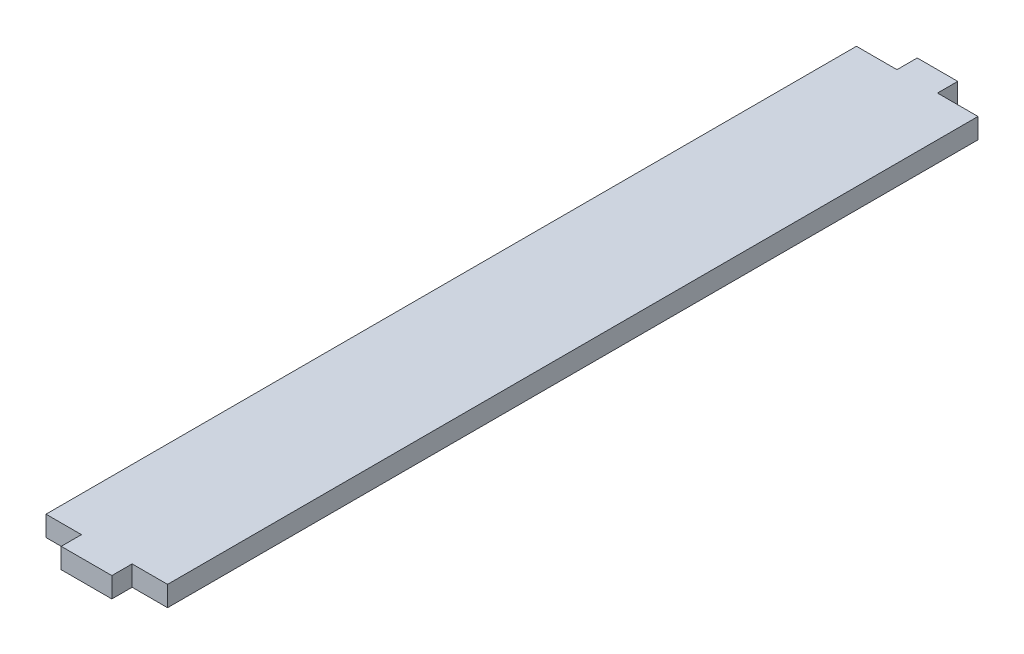
ISO-10303-21;
HEADER;
FILE_DESCRIPTION(('STEP AP214'),'2;1');
FILE_NAME('part.step','',(''),(''),'','','');
FILE_SCHEMA(('AUTOMOTIVE_DESIGN { 1 0 10303 214 1 1 1 1 }'));
ENDSEC;
DATA;
#1=APPLICATION_CONTEXT('core data for automotive mechanical design processes');
#2=APPLICATION_PROTOCOL_DEFINITION('international standard','automotive_design',2000,#1);
#3=PRODUCT_CONTEXT('',#1,'mechanical');
#4=PRODUCT('Part','Part','',(#3));
#5=PRODUCT_RELATED_PRODUCT_CATEGORY('part','',(#4));
#6=PRODUCT_DEFINITION_FORMATION('','',#4);
#7=PRODUCT_DEFINITION_CONTEXT('part definition',#1,'design');
#8=PRODUCT_DEFINITION('design','',#6,#7);
#9=PRODUCT_DEFINITION_SHAPE('','',#8);
#10=(LENGTH_UNIT() NAMED_UNIT(*) SI_UNIT(.MILLI.,.METRE.));
#11=(NAMED_UNIT(*) PLANE_ANGLE_UNIT() SI_UNIT($,.RADIAN.));
#12=(NAMED_UNIT(*) SI_UNIT($,.STERADIAN.) SOLID_ANGLE_UNIT());
#13=UNCERTAINTY_MEASURE_WITH_UNIT(LENGTH_MEASURE(1.E-05),#10,'distance_accuracy_value','');
#14=(GEOMETRIC_REPRESENTATION_CONTEXT(3) GLOBAL_UNCERTAINTY_ASSIGNED_CONTEXT((#13)) GLOBAL_UNIT_ASSIGNED_CONTEXT((#10,
#11,#12)) REPRESENTATION_CONTEXT('',''));
#15=CARTESIAN_POINT('',(0.,0.,0.));
#16=DIRECTION('',(0.,0.,1.));
#17=DIRECTION('',(1.,0.,0.));
#18=AXIS2_PLACEMENT_3D('',#15,#16,#17);
#19=CARTESIAN_POINT('',(-81.9746376057991,5.,31.5625003395719));
#20=DIRECTION('',(0.,0.,-1.));
#21=DIRECTION('',(-1.,0.,0.));
#22=AXIS2_PLACEMENT_3D('',#19,#20,#21);
#23=PLANE('',#22);
#24=DIRECTION('',(1.,0.,0.));
#25=VECTOR('',#24,1.);
#26=CARTESIAN_POINT('',(-81.9746376057991,0.,31.5625003395719));
#27=LINE('',#26,#25);
#28=CARTESIAN_POINT('',(89.4167837504382,0.,31.5625003395718));
#29=VERTEX_POINT('',#28);
#30=CARTESIAN_POINT('',(98.1667837504382,0.,31.5625003395718));
#31=VERTEX_POINT('',#30);
#32=EDGE_CURVE('E240',#29,#31,#27,.T.);
#33=ORIENTED_EDGE('',*,*,#32,.T.);
#34=DIRECTION('',(0.,-1.,0.));
#35=VECTOR('',#34,1.);
#36=CARTESIAN_POINT('',(98.1667837504382,5.,31.5625003395718));
#37=LINE('',#36,#35);
#38=CARTESIAN_POINT('',(98.1667837504382,5.,31.5625003395718));
#39=VERTEX_POINT('',#38);
#40=EDGE_CURVE('E138',#39,#31,#37,.T.);
#41=ORIENTED_EDGE('',*,*,#40,.F.);
#42=DIRECTION('',(1.,0.,0.));
#43=VECTOR('',#42,1.);
#44=CARTESIAN_POINT('',(-81.9746376057991,5.,31.5625003395719));
#45=LINE('',#44,#43);
#46=CARTESIAN_POINT('',(89.4167837504382,5.,31.5625003395718));
#47=VERTEX_POINT('',#46);
#48=EDGE_CURVE('E287',#47,#39,#45,.T.);
#49=ORIENTED_EDGE('',*,*,#48,.F.);
#50=DIRECTION('',(0.,-1.,0.));
#51=VECTOR('',#50,1.);
#52=CARTESIAN_POINT('',(89.4167837504382,5.,31.5625003395718));
#53=LINE('',#52,#51);
#54=EDGE_CURVE('E12',#47,#29,#53,.T.);
#55=ORIENTED_EDGE('',*,*,#54,.T.);
#56=EDGE_LOOP('',(#33,#41,#49,#55));
#57=FACE_BOUND('',#56,.T.);
#58=ADVANCED_FACE('F128',(#57),#23,.F.);
#59=CARTESIAN_POINT('',(98.1667837504382,5.,-68.4374996604282));
#60=DIRECTION('',(1.,0.,0.));
#61=DIRECTION('',(0.,0.,-1.));
#62=AXIS2_PLACEMENT_3D('',#59,#60,#61);
#63=PLANE('',#62);
#64=DIRECTION('',(0.,0.,1.));
#65=VECTOR('',#64,1.);
#66=CARTESIAN_POINT('',(98.1667837504382,0.,-68.4374996604282));
#67=LINE('',#66,#65);
#68=CARTESIAN_POINT('',(98.1667837504382,0.,-168.437499660428));
#69=VERTEX_POINT('',#68);
#70=EDGE_CURVE('E273',#69,#31,#67,.T.);
#71=ORIENTED_EDGE('',*,*,#70,.F.);
#72=DIRECTION('',(0.,-1.,0.));
#73=VECTOR('',#72,1.);
#74=CARTESIAN_POINT('',(98.1667837504382,5.,-168.437499660428));
#75=LINE('',#74,#73);
#76=CARTESIAN_POINT('',(98.1667837504382,5.,-168.437499660428));
#77=VERTEX_POINT('',#76);
#78=EDGE_CURVE('E255',#77,#69,#75,.T.);
#79=ORIENTED_EDGE('',*,*,#78,.F.);
#80=DIRECTION('',(0.,0.,1.));
#81=VECTOR('',#80,1.);
#82=CARTESIAN_POINT('',(98.1667837504382,5.,-68.4374996604282));
#83=LINE('',#82,#81);
#84=EDGE_CURVE('E284',#77,#39,#83,.T.);
#85=ORIENTED_EDGE('',*,*,#84,.T.);
#86=ORIENTED_EDGE('',*,*,#40,.T.);
#87=EDGE_LOOP('',(#71,#79,#85,#86));
#88=FACE_BOUND('',#87,.T.);
#89=ADVANCED_FACE('F326',(#88),#63,.T.);
#90=CARTESIAN_POINT('',(-81.9746376057991,5.,-168.437499660428));
#91=DIRECTION('',(0.,0.,-1.));
#92=DIRECTION('',(-1.,0.,0.));
#93=AXIS2_PLACEMENT_3D('',#90,#91,#92);
#94=PLANE('',#93);
#95=DIRECTION('',(1.,0.,0.));
#96=VECTOR('',#95,1.);
#97=CARTESIAN_POINT('',(-81.9746376057991,0.,-168.437499660428));
#98=LINE('',#97,#96);
#99=CARTESIAN_POINT('',(88.1667837504382,0.,-168.437499660428));
#100=VERTEX_POINT('',#99);
#101=EDGE_CURVE('E271',#100,#69,#98,.T.);
#102=ORIENTED_EDGE('',*,*,#101,.F.);
#103=DIRECTION('',(0.,-1.,0.));
#104=VECTOR('',#103,1.);
#105=CARTESIAN_POINT('',(88.1667837504382,5.,-168.437499660428));
#106=LINE('',#105,#104);
#107=CARTESIAN_POINT('',(88.1667837504382,5.,-168.437499660428));
#108=VERTEX_POINT('',#107);
#109=EDGE_CURVE('E213',#108,#100,#106,.T.);
#110=ORIENTED_EDGE('',*,*,#109,.F.);
#111=DIRECTION('',(1.,0.,0.));
#112=VECTOR('',#111,1.);
#113=CARTESIAN_POINT('',(-81.9746376057991,5.,-168.437499660428));
#114=LINE('',#113,#112);
#115=EDGE_CURVE('E281',#108,#77,#114,.T.);
#116=ORIENTED_EDGE('',*,*,#115,.T.);
#117=ORIENTED_EDGE('',*,*,#78,.T.);
#118=EDGE_LOOP('',(#102,#110,#116,#117));
#119=FACE_BOUND('',#118,.T.);
#120=ADVANCED_FACE('F330',(#119),#94,.T.);
#121=CARTESIAN_POINT('',(68.1667837504382,0.,-168.437499660428));
#122=VERTEX_POINT('',#121);
#123=CARTESIAN_POINT('',(78.1667837504382,0.,-168.437499660428));
#124=VERTEX_POINT('',#123);
#125=EDGE_CURVE('E270',#122,#124,#98,.T.);
#126=ORIENTED_EDGE('',*,*,#125,.F.);
#127=DIRECTION('',(0.,-1.,0.));
#128=VECTOR('',#127,1.);
#129=CARTESIAN_POINT('',(68.1667837504382,5.,-168.437499660428));
#130=LINE('',#129,#128);
#131=CARTESIAN_POINT('',(68.1667837504382,5.,-168.437499660428));
#132=VERTEX_POINT('',#131);
#133=EDGE_CURVE('E260',#132,#122,#130,.T.);
#134=ORIENTED_EDGE('',*,*,#133,.F.);
#135=CARTESIAN_POINT('',(78.1667837504382,5.,-168.437499660428));
#136=VERTEX_POINT('',#135);
#137=EDGE_CURVE('E280',#132,#136,#114,.T.);
#138=ORIENTED_EDGE('',*,*,#137,.T.);
#139=DIRECTION('',(0.,-1.,0.));
#140=VECTOR('',#139,1.);
#141=CARTESIAN_POINT('',(78.1667837504382,5.,-168.437499660428));
#142=LINE('',#141,#140);
#143=EDGE_CURVE('E258',#136,#124,#142,.T.);
#144=ORIENTED_EDGE('',*,*,#143,.T.);
#145=EDGE_LOOP('',(#126,#134,#138,#144));
#146=FACE_BOUND('',#145,.T.);
#147=ADVANCED_FACE('F340',(#146),#94,.T.);
#148=CARTESIAN_POINT('',(68.1667837504382,5.,-68.4374996604282));
#149=DIRECTION('',(1.,0.,0.));
#150=DIRECTION('',(0.,0.,-1.));
#151=AXIS2_PLACEMENT_3D('',#148,#149,#150);
#152=PLANE('',#151);
#153=DIRECTION('',(0.,0.,1.));
#154=VECTOR('',#153,1.);
#155=CARTESIAN_POINT('',(68.1667837504382,0.,-68.4374996604282));
#156=LINE('',#155,#154);
#157=CARTESIAN_POINT('',(68.1667837504382,0.,31.5625003395718));
#158=VERTEX_POINT('',#157);
#159=EDGE_CURVE('E267',#122,#158,#156,.T.);
#160=ORIENTED_EDGE('',*,*,#159,.T.);
#161=DIRECTION('',(0.,-1.,0.));
#162=VECTOR('',#161,1.);
#163=CARTESIAN_POINT('',(68.1667837504382,5.,31.5625003395718));
#164=LINE('',#163,#162);
#165=CARTESIAN_POINT('',(68.1667837504382,5.,31.5625003395718));
#166=VERTEX_POINT('',#165);
#167=EDGE_CURVE('E262',#166,#158,#164,.T.);
#168=ORIENTED_EDGE('',*,*,#167,.F.);
#169=DIRECTION('',(0.,0.,1.));
#170=VECTOR('',#169,1.);
#171=CARTESIAN_POINT('',(68.1667837504382,5.,-68.4374996604282));
#172=LINE('',#171,#170);
#173=EDGE_CURVE('E278',#132,#166,#172,.T.);
#174=ORIENTED_EDGE('',*,*,#173,.F.);
#175=ORIENTED_EDGE('',*,*,#133,.T.);
#176=EDGE_LOOP('',(#160,#168,#174,#175));
#177=FACE_BOUND('',#176,.T.);
#178=ADVANCED_FACE('F341',(#177),#152,.F.);
#179=CARTESIAN_POINT('',(76.9167837504383,0.,31.5625003395718));
#180=VERTEX_POINT('',#179);
#181=EDGE_CURVE('E269',#158,#180,#27,.T.);
#182=ORIENTED_EDGE('',*,*,#181,.T.);
#183=DIRECTION('',(0.,-1.,0.));
#184=VECTOR('',#183,1.);
#185=CARTESIAN_POINT('',(76.9167837504383,5.,31.5625003395718));
#186=LINE('',#185,#184);
#187=CARTESIAN_POINT('',(76.9167837504383,5.,31.5625003395718));
#188=VERTEX_POINT('',#187);
#189=EDGE_CURVE('E147',#188,#180,#186,.T.);
#190=ORIENTED_EDGE('',*,*,#189,.F.);
#191=EDGE_CURVE('E266',#166,#188,#45,.T.);
#192=ORIENTED_EDGE('',*,*,#191,.F.);
#193=ORIENTED_EDGE('',*,*,#167,.T.);
#194=EDGE_LOOP('',(#182,#190,#192,#193));
#195=FACE_BOUND('',#194,.T.);
#196=ADVANCED_FACE('F301',(#195),#23,.F.);
#197=CARTESIAN_POINT('',(-81.9746376057991,0.,-68.4374996604282));
#198=DIRECTION('',(0.,1.,0.));
#199=DIRECTION('',(0.,0.,1.));
#200=AXIS2_PLACEMENT_3D('',#197,#198,#199);
#201=PLANE('',#200);
#202=DIRECTION('',(0.,0.,-1.));
#203=VECTOR('',#202,1.);
#204=CARTESIAN_POINT('',(88.1667837504382,0.,-163.437499660428));
#205=LINE('',#204,#203);
#206=CARTESIAN_POINT('',(88.1667837504382,0.,-173.437499660428));
#207=VERTEX_POINT('',#206);
#208=EDGE_CURVE('E206',#100,#207,#205,.T.);
#209=ORIENTED_EDGE('',*,*,#208,.F.);
#210=ORIENTED_EDGE('',*,*,#101,.T.);
#211=ORIENTED_EDGE('',*,*,#70,.T.);
#212=ORIENTED_EDGE('',*,*,#32,.F.);
#213=DIRECTION('',(0.,0.,-1.));
#214=VECTOR('',#213,1.);
#215=CARTESIAN_POINT('',(89.4167837504382,0.,36.5625003395718));
#216=LINE('',#215,#214);
#217=CARTESIAN_POINT('',(89.4167837504382,0.,36.5625003395718));
#218=VERTEX_POINT('',#217);
#219=EDGE_CURVE('E244',#218,#29,#216,.T.);
#220=ORIENTED_EDGE('',*,*,#219,.F.);
#221=DIRECTION('',(1.,0.,0.));
#222=VECTOR('',#221,1.);
#223=CARTESIAN_POINT('',(76.9167837504383,0.,36.5625003395718));
#224=LINE('',#223,#222);
#225=CARTESIAN_POINT('',(76.9167837504383,0.,36.5625003395718));
#226=VERTEX_POINT('',#225);
#227=EDGE_CURVE('E241',#226,#218,#224,.T.);
#228=ORIENTED_EDGE('',*,*,#227,.F.);
#229=DIRECTION('',(0.,0.,-1.));
#230=VECTOR('',#229,1.);
#231=CARTESIAN_POINT('',(76.9167837504383,0.,36.5625003395718));
#232=LINE('',#231,#230);
#233=EDGE_CURVE('E225',#226,#180,#232,.T.);
#234=ORIENTED_EDGE('',*,*,#233,.T.);
#235=ORIENTED_EDGE('',*,*,#181,.F.);
#236=ORIENTED_EDGE('',*,*,#159,.F.);
#237=ORIENTED_EDGE('',*,*,#125,.T.);
#238=DIRECTION('',(0.,0.,-1.));
#239=VECTOR('',#238,1.);
#240=CARTESIAN_POINT('',(78.1667837504382,0.,-163.437499660428));
#241=LINE('',#240,#239);
#242=CARTESIAN_POINT('',(78.1667837504382,0.,-173.437499660428));
#243=VERTEX_POINT('',#242);
#244=EDGE_CURVE('E200',#124,#243,#241,.T.);
#245=ORIENTED_EDGE('',*,*,#244,.T.);
#246=DIRECTION('',(1.,0.,0.));
#247=VECTOR('',#246,1.);
#248=CARTESIAN_POINT('',(78.1667837504382,0.,-173.437499660428));
#249=LINE('',#248,#247);
#250=EDGE_CURVE('E217',#243,#207,#249,.T.);
#251=ORIENTED_EDGE('',*,*,#250,.T.);
#252=EDGE_LOOP('',(#209,#210,#211,#212,#220,#228,#234,#235,#236,#237,#245,#251));
#253=FACE_BOUND('',#252,.T.);
#254=ADVANCED_FACE('F226',(#253),#201,.F.);
#255=CARTESIAN_POINT('',(-81.9746376057991,5.,-68.4374996604282));
#256=DIRECTION('',(0.,1.,0.));
#257=DIRECTION('',(0.,0.,1.));
#258=AXIS2_PLACEMENT_3D('',#255,#256,#257);
#259=PLANE('',#258);
#260=ORIENTED_EDGE('',*,*,#115,.F.);
#261=DIRECTION('',(0.,0.,-1.));
#262=VECTOR('',#261,1.);
#263=CARTESIAN_POINT('',(88.1667837504382,5.,-163.437499660428));
#264=LINE('',#263,#262);
#265=CARTESIAN_POINT('',(88.1667837504382,5.,-173.437499660428));
#266=VERTEX_POINT('',#265);
#267=EDGE_CURVE('E230',#108,#266,#264,.T.);
#268=ORIENTED_EDGE('',*,*,#267,.T.);
#269=DIRECTION('',(1.,0.,0.));
#270=VECTOR('',#269,1.);
#271=CARTESIAN_POINT('',(78.1667837504382,5.,-173.437499660428));
#272=LINE('',#271,#270);
#273=CARTESIAN_POINT('',(78.1667837504382,5.,-173.437499660428));
#274=VERTEX_POINT('',#273);
#275=EDGE_CURVE('E224',#274,#266,#272,.T.);
#276=ORIENTED_EDGE('',*,*,#275,.F.);
#277=DIRECTION('',(0.,0.,-1.));
#278=VECTOR('',#277,1.);
#279=CARTESIAN_POINT('',(78.1667837504382,5.,-163.437499660428));
#280=LINE('',#279,#278);
#281=EDGE_CURVE('E216',#136,#274,#280,.T.);
#282=ORIENTED_EDGE('',*,*,#281,.F.);
#283=ORIENTED_EDGE('',*,*,#137,.F.);
#284=ORIENTED_EDGE('',*,*,#173,.T.);
#285=ORIENTED_EDGE('',*,*,#191,.T.);
#286=DIRECTION('',(0.,0.,-1.));
#287=VECTOR('',#286,1.);
#288=CARTESIAN_POINT('',(76.9167837504383,5.,36.5625003395718));
#289=LINE('',#288,#287);
#290=CARTESIAN_POINT('',(76.9167837504383,5.,36.5625003395718));
#291=VERTEX_POINT('',#290);
#292=EDGE_CURVE('E243',#291,#188,#289,.T.);
#293=ORIENTED_EDGE('',*,*,#292,.F.);
#294=DIRECTION('',(1.,0.,0.));
#295=VECTOR('',#294,1.);
#296=CARTESIAN_POINT('',(76.9167837504383,5.,36.5625003395718));
#297=LINE('',#296,#295);
#298=CARTESIAN_POINT('',(89.4167837504382,5.,36.5625003395718));
#299=VERTEX_POINT('',#298);
#300=EDGE_CURVE('E238',#291,#299,#297,.T.);
#301=ORIENTED_EDGE('',*,*,#300,.T.);
#302=DIRECTION('',(0.,0.,-1.));
#303=VECTOR('',#302,1.);
#304=CARTESIAN_POINT('',(89.4167837504382,5.,36.5625003395718));
#305=LINE('',#304,#303);
#306=EDGE_CURVE('E250',#299,#47,#305,.T.);
#307=ORIENTED_EDGE('',*,*,#306,.T.);
#308=ORIENTED_EDGE('',*,*,#48,.T.);
#309=ORIENTED_EDGE('',*,*,#84,.F.);
#310=EDGE_LOOP('',(#260,#268,#276,#282,#283,#284,#285,#293,#301,#307,#308,#309));
#311=FACE_BOUND('',#310,.T.);
#312=ADVANCED_FACE('F297',(#311),#259,.T.);
#313=CARTESIAN_POINT('',(88.1667837504382,5.,-163.437499660428));
#314=DIRECTION('',(-1.,0.,0.));
#315=DIRECTION('',(0.,0.,1.));
#316=AXIS2_PLACEMENT_3D('',#313,#314,#315);
#317=PLANE('',#316);
#318=ORIENTED_EDGE('',*,*,#267,.F.);
#319=ORIENTED_EDGE('',*,*,#109,.T.);
#320=ORIENTED_EDGE('',*,*,#208,.T.);
#321=DIRECTION('',(0.,-1.,0.));
#322=VECTOR('',#321,1.);
#323=CARTESIAN_POINT('',(88.1667837504382,5.,-173.437499660428));
#324=LINE('',#323,#322);
#325=EDGE_CURVE('E210',#266,#207,#324,.T.);
#326=ORIENTED_EDGE('',*,*,#325,.F.);
#327=EDGE_LOOP('',(#318,#319,#320,#326));
#328=FACE_BOUND('',#327,.T.);
#329=ADVANCED_FACE('F209',(#328),#317,.F.);
#330=CARTESIAN_POINT('',(78.1667837504382,5.,-173.437499660428));
#331=DIRECTION('',(0.,0.,-1.));
#332=DIRECTION('',(-1.,0.,0.));
#333=AXIS2_PLACEMENT_3D('',#330,#331,#332);
#334=PLANE('',#333);
#335=ORIENTED_EDGE('',*,*,#250,.F.);
#336=DIRECTION('',(0.,-1.,0.));
#337=VECTOR('',#336,1.);
#338=CARTESIAN_POINT('',(78.1667837504382,5.,-173.437499660428));
#339=LINE('',#338,#337);
#340=EDGE_CURVE('E132',#274,#243,#339,.T.);
#341=ORIENTED_EDGE('',*,*,#340,.F.);
#342=ORIENTED_EDGE('',*,*,#275,.T.);
#343=ORIENTED_EDGE('',*,*,#325,.T.);
#344=EDGE_LOOP('',(#335,#341,#342,#343));
#345=FACE_BOUND('',#344,.T.);
#346=ADVANCED_FACE('F221',(#345),#334,.T.);
#347=CARTESIAN_POINT('',(78.1667837504382,5.,-163.437499660428));
#348=DIRECTION('',(-1.,0.,0.));
#349=DIRECTION('',(0.,0.,1.));
#350=AXIS2_PLACEMENT_3D('',#347,#348,#349);
#351=PLANE('',#350);
#352=ORIENTED_EDGE('',*,*,#244,.F.);
#353=ORIENTED_EDGE('',*,*,#143,.F.);
#354=ORIENTED_EDGE('',*,*,#281,.T.);
#355=ORIENTED_EDGE('',*,*,#340,.T.);
#356=EDGE_LOOP('',(#352,#353,#354,#355));
#357=FACE_BOUND('',#356,.T.);
#358=ADVANCED_FACE('F130',(#357),#351,.T.);
#359=CARTESIAN_POINT('',(76.9167837504383,5.,36.5625003395718));
#360=DIRECTION('',(0.,0.,-1.));
#361=DIRECTION('',(-1.,0.,0.));
#362=AXIS2_PLACEMENT_3D('',#359,#360,#361);
#363=PLANE('',#362);
#364=ORIENTED_EDGE('',*,*,#227,.T.);
#365=DIRECTION('',(0.,-1.,0.));
#366=VECTOR('',#365,1.);
#367=CARTESIAN_POINT('',(89.4167837504382,5.,36.5625003395718));
#368=LINE('',#367,#366);
#369=EDGE_CURVE('E234',#299,#218,#368,.T.);
#370=ORIENTED_EDGE('',*,*,#369,.F.);
#371=ORIENTED_EDGE('',*,*,#300,.F.);
#372=DIRECTION('',(0.,-1.,0.));
#373=VECTOR('',#372,1.);
#374=CARTESIAN_POINT('',(76.9167837504383,5.,36.5625003395718));
#375=LINE('',#374,#373);
#376=EDGE_CURVE('E237',#291,#226,#375,.T.);
#377=ORIENTED_EDGE('',*,*,#376,.T.);
#378=EDGE_LOOP('',(#364,#370,#371,#377));
#379=FACE_BOUND('',#378,.T.);
#380=ADVANCED_FACE('F314',(#379),#363,.F.);
#381=CARTESIAN_POINT('',(89.4167837504382,5.,36.5625003395718));
#382=DIRECTION('',(-1.,0.,0.));
#383=DIRECTION('',(0.,0.,1.));
#384=AXIS2_PLACEMENT_3D('',#381,#382,#383);
#385=PLANE('',#384);
#386=ORIENTED_EDGE('',*,*,#219,.T.);
#387=ORIENTED_EDGE('',*,*,#54,.F.);
#388=ORIENTED_EDGE('',*,*,#306,.F.);
#389=ORIENTED_EDGE('',*,*,#369,.T.);
#390=EDGE_LOOP('',(#386,#387,#388,#389));
#391=FACE_BOUND('',#390,.T.);
#392=ADVANCED_FACE('F366',(#391),#385,.F.);
#393=CARTESIAN_POINT('',(76.9167837504383,5.,36.5625003395718));
#394=DIRECTION('',(-1.,0.,0.));
#395=DIRECTION('',(0.,0.,1.));
#396=AXIS2_PLACEMENT_3D('',#393,#394,#395);
#397=PLANE('',#396);
#398=ORIENTED_EDGE('',*,*,#292,.T.);
#399=ORIENTED_EDGE('',*,*,#189,.T.);
#400=ORIENTED_EDGE('',*,*,#233,.F.);
#401=ORIENTED_EDGE('',*,*,#376,.F.);
#402=EDGE_LOOP('',(#398,#399,#400,#401));
#403=FACE_BOUND('',#402,.T.);
#404=ADVANCED_FACE('F310',(#403),#397,.T.);
#405=CLOSED_SHELL('',(#58,#89,#120,#147,#178,#196,#254,#312,#329,#346,#358,#380,#392,#404));
#406=MANIFOLD_SOLID_BREP('B2',#405);
#407=ADVANCED_BREP_SHAPE_REPRESENTATION('',(#18,#406),#14);
#408=SHAPE_DEFINITION_REPRESENTATION(#9,#407);
ENDSEC;
END-ISO-10303-21;
